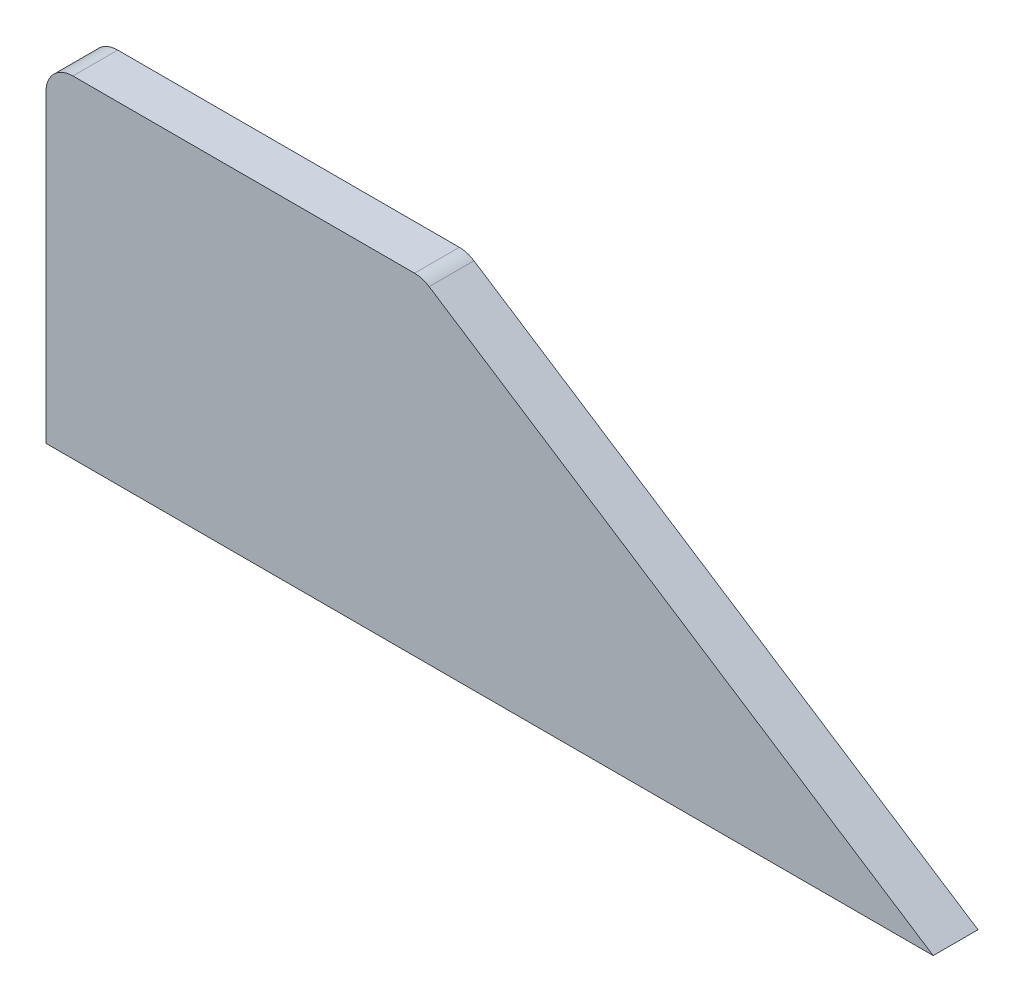
ISO-10303-21;
HEADER;
FILE_DESCRIPTION(('STEP AP214'),'2;1');
FILE_NAME('part.step','',(''),(''),'','','');
FILE_SCHEMA(('AUTOMOTIVE_DESIGN { 1 0 10303 214 1 1 1 1 }'));
ENDSEC;
DATA;
#1=APPLICATION_CONTEXT('core data for automotive mechanical design processes');
#2=APPLICATION_PROTOCOL_DEFINITION('international standard','automotive_design',2000,#1);
#3=PRODUCT_CONTEXT('',#1,'mechanical');
#4=PRODUCT('Part','Part','',(#3));
#5=PRODUCT_RELATED_PRODUCT_CATEGORY('part','',(#4));
#6=PRODUCT_DEFINITION_FORMATION('','',#4);
#7=PRODUCT_DEFINITION_CONTEXT('part definition',#1,'design');
#8=PRODUCT_DEFINITION('design','',#6,#7);
#9=PRODUCT_DEFINITION_SHAPE('','',#8);
#10=(LENGTH_UNIT() NAMED_UNIT(*) SI_UNIT(.MILLI.,.METRE.));
#11=(NAMED_UNIT(*) PLANE_ANGLE_UNIT() SI_UNIT($,.RADIAN.));
#12=(NAMED_UNIT(*) SI_UNIT($,.STERADIAN.) SOLID_ANGLE_UNIT());
#13=UNCERTAINTY_MEASURE_WITH_UNIT(LENGTH_MEASURE(1.E-05),#10,'distance_accuracy_value','');
#14=(GEOMETRIC_REPRESENTATION_CONTEXT(3) GLOBAL_UNCERTAINTY_ASSIGNED_CONTEXT((#13)) GLOBAL_UNIT_ASSIGNED_CONTEXT((#10,
#11,#12)) REPRESENTATION_CONTEXT('',''));
#15=CARTESIAN_POINT('',(0.,0.,0.));
#16=DIRECTION('',(0.,0.,1.));
#17=DIRECTION('',(1.,0.,0.));
#18=AXIS2_PLACEMENT_3D('',#15,#16,#17);
#19=CARTESIAN_POINT('',(0.,0.,5.));
#20=DIRECTION('',(1.,0.,0.));
#21=DIRECTION('',(0.,1.,0.));
#22=AXIS2_PLACEMENT_3D('',#19,#20,#21);
#23=PLANE('',#22);
#24=DIRECTION('',(0.,-1.,0.));
#25=VECTOR('',#24,1.);
#26=CARTESIAN_POINT('',(0.,0.,0.));
#27=LINE('',#26,#25);
#28=CARTESIAN_POINT('',(1.16226472890446E-13,34.,0.));
#29=VERTEX_POINT('',#28);
#30=CARTESIAN_POINT('',(0.,0.,0.));
#31=VERTEX_POINT('',#30);
#32=EDGE_CURVE('E117',#29,#31,#27,.T.);
#33=ORIENTED_EDGE('',*,*,#32,.T.);
#34=DIRECTION('',(0.,0.,-1.));
#35=VECTOR('',#34,1.);
#36=CARTESIAN_POINT('',(0.,0.,5.));
#37=LINE('',#36,#35);
#38=CARTESIAN_POINT('',(0.,0.,5.));
#39=VERTEX_POINT('',#38);
#40=EDGE_CURVE('E11',#39,#31,#37,.T.);
#41=ORIENTED_EDGE('',*,*,#40,.F.);
#42=DIRECTION('',(0.,-1.,0.));
#43=VECTOR('',#42,1.);
#44=CARTESIAN_POINT('',(0.,0.,5.));
#45=LINE('',#44,#43);
#46=CARTESIAN_POINT('',(1.16226472890446E-13,34.,5.));
#47=VERTEX_POINT('',#46);
#48=EDGE_CURVE('E127',#47,#39,#45,.T.);
#49=ORIENTED_EDGE('',*,*,#48,.F.);
#50=DIRECTION('',(0.,0.,-1.));
#51=VECTOR('',#50,1.);
#52=CARTESIAN_POINT('',(1.16226472890446E-13,34.,5.));
#53=LINE('',#52,#51);
#54=EDGE_CURVE('E113',#47,#29,#53,.T.);
#55=ORIENTED_EDGE('',*,*,#54,.T.);
#56=EDGE_LOOP('',(#33,#41,#49,#55));
#57=FACE_BOUND('',#56,.T.);
#58=ADVANCED_FACE('F33',(#57),#23,.F.);
#59=CARTESIAN_POINT('',(0.,0.,5.));
#60=DIRECTION('',(0.,1.,0.));
#61=DIRECTION('',(-1.,0.,0.));
#62=AXIS2_PLACEMENT_3D('',#59,#60,#61);
#63=PLANE('',#62);
#64=DIRECTION('',(1.,0.,0.));
#65=VECTOR('',#64,1.);
#66=CARTESIAN_POINT('',(0.,0.,0.));
#67=LINE('',#66,#65);
#68=CARTESIAN_POINT('',(98.9750036611403,0.,0.));
#69=VERTEX_POINT('',#68);
#70=EDGE_CURVE('E120',#31,#69,#67,.T.);
#71=ORIENTED_EDGE('',*,*,#70,.T.);
#72=DIRECTION('',(0.,0.,-1.));
#73=VECTOR('',#72,1.);
#74=CARTESIAN_POINT('',(98.9750036611403,0.,5.));
#75=LINE('',#74,#73);
#76=CARTESIAN_POINT('',(98.9750036611403,0.,5.));
#77=VERTEX_POINT('',#76);
#78=EDGE_CURVE('E41',#77,#69,#75,.T.);
#79=ORIENTED_EDGE('',*,*,#78,.F.);
#80=DIRECTION('',(1.,0.,0.));
#81=VECTOR('',#80,1.);
#82=CARTESIAN_POINT('',(0.,0.,5.));
#83=LINE('',#82,#81);
#84=EDGE_CURVE('E86',#39,#77,#83,.T.);
#85=ORIENTED_EDGE('',*,*,#84,.F.);
#86=ORIENTED_EDGE('',*,*,#40,.T.);
#87=EDGE_LOOP('',(#71,#79,#85,#86));
#88=FACE_BOUND('',#87,.T.);
#89=ADVANCED_FACE('F151',(#88),#63,.F.);
#90=CARTESIAN_POINT('',(98.9750036611403,0.,5.));
#91=DIRECTION('',(-0.544639035015023,-0.838670567945426,0.));
#92=DIRECTION('',(0.838670567945426,-0.544639035015023,0.));
#93=AXIS2_PLACEMENT_3D('',#90,#91,#92);
#94=PLANE('',#93);
#95=DIRECTION('',(-0.838670567945426,0.544639035015023,0.));
#96=VECTOR('',#95,1.);
#97=CARTESIAN_POINT('',(98.9750036611403,0.,0.));
#98=LINE('',#97,#96);
#99=CARTESIAN_POINT('',(42.745276620159,36.5160117038363,0.));
#100=VERTEX_POINT('',#99);
#101=EDGE_CURVE('E122',#69,#100,#98,.T.);
#102=ORIENTED_EDGE('',*,*,#101,.T.);
#103=DIRECTION('',(0.,0.,-1.));
#104=VECTOR('',#103,1.);
#105=CARTESIAN_POINT('',(42.745276620159,36.5160117038363,5.));
#106=LINE('',#105,#104);
#107=CARTESIAN_POINT('',(42.745276620159,36.5160117038363,5.));
#108=VERTEX_POINT('',#107);
#109=EDGE_CURVE('E108',#108,#100,#106,.T.);
#110=ORIENTED_EDGE('',*,*,#109,.F.);
#111=DIRECTION('',(-0.838670567945426,0.544639035015023,0.));
#112=VECTOR('',#111,1.);
#113=CARTESIAN_POINT('',(98.9750036611403,0.,5.));
#114=LINE('',#113,#112);
#115=EDGE_CURVE('E99',#77,#108,#114,.T.);
#116=ORIENTED_EDGE('',*,*,#115,.F.);
#117=ORIENTED_EDGE('',*,*,#78,.T.);
#118=EDGE_LOOP('',(#102,#110,#116,#117));
#119=FACE_BOUND('',#118,.T.);
#120=ADVANCED_FACE('F133',(#119),#94,.F.);
#121=CARTESIAN_POINT('',(41.1113595151139,34.,5.));
#122=DIRECTION('',(0.,0.,-1.));
#123=DIRECTION('',(-1.,0.,0.));
#124=AXIS2_PLACEMENT_3D('',#121,#122,#123);
#125=CYLINDRICAL_SURFACE('',#124,3.00000000000008);
#126=CARTESIAN_POINT('',(41.1113595151139,34.,0.));
#127=DIRECTION('',(0.,0.,1.));
#128=DIRECTION('',(-1.,0.,0.));
#129=AXIS2_PLACEMENT_3D('',#126,#127,#128);
#130=CIRCLE('',#129,3.00000000000008);
#131=CARTESIAN_POINT('',(41.1113595151139,37.,0.));
#132=VERTEX_POINT('',#131);
#133=EDGE_CURVE('E107',#100,#132,#130,.T.);
#134=ORIENTED_EDGE('',*,*,#133,.T.);
#135=DIRECTION('',(0.,0.,-1.));
#136=VECTOR('',#135,1.);
#137=CARTESIAN_POINT('',(41.1113595151139,37.,5.));
#138=LINE('',#137,#136);
#139=CARTESIAN_POINT('',(41.1113595151139,37.,5.));
#140=VERTEX_POINT('',#139);
#141=EDGE_CURVE('E104',#140,#132,#138,.T.);
#142=ORIENTED_EDGE('',*,*,#141,.F.);
#143=CARTESIAN_POINT('',(41.1113595151139,34.,5.));
#144=DIRECTION('',(0.,0.,1.));
#145=DIRECTION('',(-1.,0.,0.));
#146=AXIS2_PLACEMENT_3D('',#143,#144,#145);
#147=CIRCLE('',#146,3.00000000000008);
#148=EDGE_CURVE('E93',#108,#140,#147,.T.);
#149=ORIENTED_EDGE('',*,*,#148,.F.);
#150=ORIENTED_EDGE('',*,*,#109,.T.);
#151=EDGE_LOOP('',(#134,#142,#149,#150));
#152=FACE_BOUND('',#151,.T.);
#153=ADVANCED_FACE('F105',(#152),#125,.T.);
#154=CARTESIAN_POINT('',(3.00000000000012,37.,5.));
#155=DIRECTION('',(0.,-1.,0.));
#156=DIRECTION('',(1.,0.,0.));
#157=AXIS2_PLACEMENT_3D('',#154,#155,#156);
#158=PLANE('',#157);
#159=DIRECTION('',(-1.,0.,0.));
#160=VECTOR('',#159,1.);
#161=CARTESIAN_POINT('',(3.00000000000012,37.,0.));
#162=LINE('',#161,#160);
#163=CARTESIAN_POINT('',(3.00000000000012,37.,0.));
#164=VERTEX_POINT('',#163);
#165=EDGE_CURVE('E72',#132,#164,#162,.T.);
#166=ORIENTED_EDGE('',*,*,#165,.T.);
#167=DIRECTION('',(0.,0.,-1.));
#168=VECTOR('',#167,1.);
#169=CARTESIAN_POINT('',(3.00000000000012,37.,5.));
#170=LINE('',#169,#168);
#171=CARTESIAN_POINT('',(3.00000000000012,37.,5.));
#172=VERTEX_POINT('',#171);
#173=EDGE_CURVE('E109',#172,#164,#170,.T.);
#174=ORIENTED_EDGE('',*,*,#173,.F.);
#175=DIRECTION('',(-1.,0.,0.));
#176=VECTOR('',#175,1.);
#177=CARTESIAN_POINT('',(3.00000000000012,37.,5.));
#178=LINE('',#177,#176);
#179=EDGE_CURVE('E97',#140,#172,#178,.T.);
#180=ORIENTED_EDGE('',*,*,#179,.F.);
#181=ORIENTED_EDGE('',*,*,#141,.T.);
#182=EDGE_LOOP('',(#166,#174,#180,#181));
#183=FACE_BOUND('',#182,.T.);
#184=ADVANCED_FACE('F111',(#183),#158,.F.);
#185=CARTESIAN_POINT('',(3.00000000000015,34.,5.));
#186=DIRECTION('',(0.,0.,-1.));
#187=DIRECTION('',(-1.,0.,0.));
#188=AXIS2_PLACEMENT_3D('',#185,#186,#187);
#189=CYLINDRICAL_SURFACE('',#188,3.00000000000004);
#190=CARTESIAN_POINT('',(3.00000000000015,34.,0.));
#191=DIRECTION('',(0.,0.,1.));
#192=DIRECTION('',(-1.,0.,0.));
#193=AXIS2_PLACEMENT_3D('',#190,#191,#192);
#194=CIRCLE('',#193,3.00000000000004);
#195=EDGE_CURVE('E78',#164,#29,#194,.T.);
#196=ORIENTED_EDGE('',*,*,#195,.T.);
#197=ORIENTED_EDGE('',*,*,#54,.F.);
#198=CARTESIAN_POINT('',(3.00000000000015,34.,5.));
#199=DIRECTION('',(0.,0.,1.));
#200=DIRECTION('',(-1.,0.,0.));
#201=AXIS2_PLACEMENT_3D('',#198,#199,#200);
#202=CIRCLE('',#201,3.00000000000004);
#203=EDGE_CURVE('E49',#172,#47,#202,.T.);
#204=ORIENTED_EDGE('',*,*,#203,.F.);
#205=ORIENTED_EDGE('',*,*,#173,.T.);
#206=EDGE_LOOP('',(#196,#197,#204,#205));
#207=FACE_BOUND('',#206,.T.);
#208=ADVANCED_FACE('F140',(#207),#189,.T.);
#209=CARTESIAN_POINT('',(3.00000000000015,34.,5.));
#210=DIRECTION('',(0.,0.,-1.));
#211=DIRECTION('',(-1.,0.,0.));
#212=AXIS2_PLACEMENT_3D('',#209,#210,#211);
#213=PLANE('',#212);
#214=ORIENTED_EDGE('',*,*,#48,.T.);
#215=ORIENTED_EDGE('',*,*,#84,.T.);
#216=ORIENTED_EDGE('',*,*,#115,.T.);
#217=ORIENTED_EDGE('',*,*,#148,.T.);
#218=ORIENTED_EDGE('',*,*,#179,.T.);
#219=ORIENTED_EDGE('',*,*,#203,.T.);
#220=EDGE_LOOP('',(#214,#215,#216,#217,#218,#219));
#221=FACE_BOUND('',#220,.T.);
#222=ADVANCED_FACE('F95',(#221),#213,.F.);
#223=CARTESIAN_POINT('',(3.00000000000015,34.,0.));
#224=DIRECTION('',(0.,0.,-1.));
#225=DIRECTION('',(-1.,0.,0.));
#226=AXIS2_PLACEMENT_3D('',#223,#224,#225);
#227=PLANE('',#226);
#228=ORIENTED_EDGE('',*,*,#32,.F.);
#229=ORIENTED_EDGE('',*,*,#195,.F.);
#230=ORIENTED_EDGE('',*,*,#165,.F.);
#231=ORIENTED_EDGE('',*,*,#133,.F.);
#232=ORIENTED_EDGE('',*,*,#101,.F.);
#233=ORIENTED_EDGE('',*,*,#70,.F.);
#234=EDGE_LOOP('',(#228,#229,#230,#231,#232,#233));
#235=FACE_BOUND('',#234,.T.);
#236=ADVANCED_FACE('F136',(#235),#227,.T.);
#237=CLOSED_SHELL('',(#58,#89,#120,#153,#184,#208,#222,#236));
#238=MANIFOLD_SOLID_BREP('B2',#237);
#239=ADVANCED_BREP_SHAPE_REPRESENTATION('',(#18,#238),#14);
#240=SHAPE_DEFINITION_REPRESENTATION(#9,#239);
ENDSEC;
END-ISO-10303-21;
